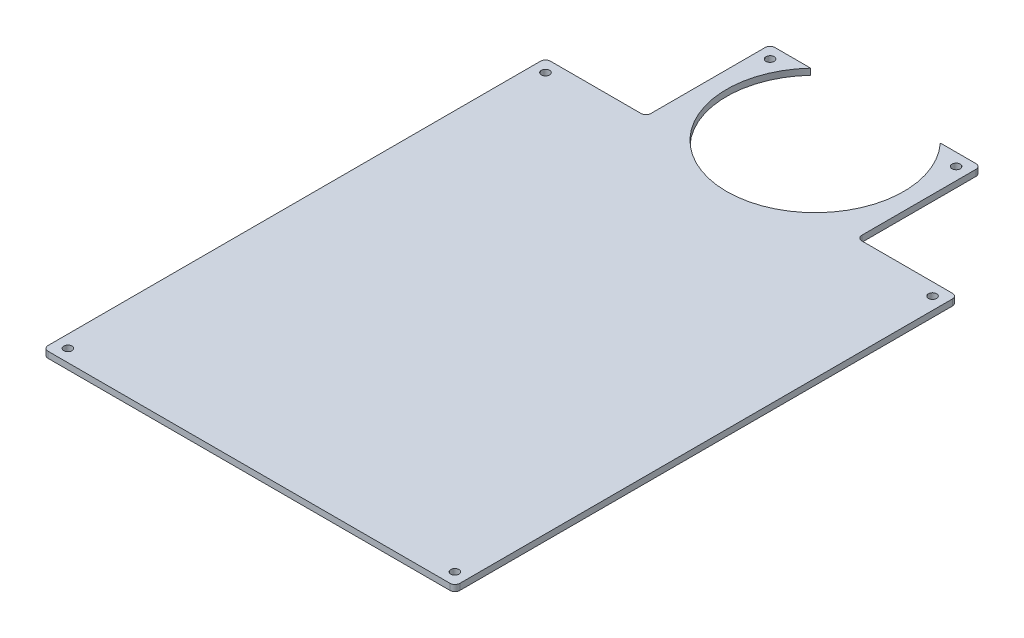
ISO-10303-21;
HEADER;
FILE_DESCRIPTION(('STEP AP214'),'2;1');
FILE_NAME('part.step','',(''),(''),'','','');
FILE_SCHEMA(('AUTOMOTIVE_DESIGN { 1 0 10303 214 1 1 1 1 }'));
ENDSEC;
DATA;
#1=APPLICATION_CONTEXT('core data for automotive mechanical design processes');
#2=APPLICATION_PROTOCOL_DEFINITION('international standard','automotive_design',2000,#1);
#3=PRODUCT_CONTEXT('',#1,'mechanical');
#4=PRODUCT('Part','Part','',(#3));
#5=PRODUCT_RELATED_PRODUCT_CATEGORY('part','',(#4));
#6=PRODUCT_DEFINITION_FORMATION('','',#4);
#7=PRODUCT_DEFINITION_CONTEXT('part definition',#1,'design');
#8=PRODUCT_DEFINITION('design','',#6,#7);
#9=PRODUCT_DEFINITION_SHAPE('','',#8);
#10=(LENGTH_UNIT() NAMED_UNIT(*) SI_UNIT(.MILLI.,.METRE.));
#11=(NAMED_UNIT(*) PLANE_ANGLE_UNIT() SI_UNIT($,.RADIAN.));
#12=(NAMED_UNIT(*) SI_UNIT($,.STERADIAN.) SOLID_ANGLE_UNIT());
#13=UNCERTAINTY_MEASURE_WITH_UNIT(LENGTH_MEASURE(1.E-05),#10,'distance_accuracy_value','');
#14=(GEOMETRIC_REPRESENTATION_CONTEXT(3) GLOBAL_UNCERTAINTY_ASSIGNED_CONTEXT((#13)) GLOBAL_UNIT_ASSIGNED_CONTEXT((#10,
#11,#12)) REPRESENTATION_CONTEXT('',''));
#15=CARTESIAN_POINT('',(0.,0.,0.));
#16=DIRECTION('',(0.,0.,1.));
#17=DIRECTION('',(1.,0.,0.));
#18=AXIS2_PLACEMENT_3D('',#15,#16,#17);
#19=CARTESIAN_POINT('',(0.,3.175,-244.475));
#20=DIRECTION('',(0.,0.,-1.));
#21=DIRECTION('',(-1.,0.,0.));
#22=AXIS2_PLACEMENT_3D('',#19,#20,#21);
#23=PLANE('',#22);
#24=DIRECTION('',(1.,0.,0.));
#25=VECTOR('',#24,1.);
#26=CARTESIAN_POINT('',(0.,3.175,-244.475));
#27=LINE('',#26,#25);
#28=CARTESIAN_POINT('',(-10.16,3.175,-244.475));
#29=VERTEX_POINT('',#28);
#30=CARTESIAN_POINT('',(36.195,3.175,-244.475));
#31=VERTEX_POINT('',#30);
#32=EDGE_CURVE('E267',#29,#31,#27,.T.);
#33=ORIENTED_EDGE('',*,*,#32,.T.);
#34=DIRECTION('',(0.,1.,0.));
#35=VECTOR('',#34,1.);
#36=CARTESIAN_POINT('',(36.195,3.175,-244.475));
#37=LINE('',#36,#35);
#38=CARTESIAN_POINT('',(36.195,0.,-244.475));
#39=VERTEX_POINT('',#38);
#40=EDGE_CURVE('E285',#31,#39,#37,.F.);
#41=ORIENTED_EDGE('',*,*,#40,.T.);
#42=DIRECTION('',(1.,0.,0.));
#43=VECTOR('',#42,1.);
#44=CARTESIAN_POINT('',(0.,0.,-244.475));
#45=LINE('',#44,#43);
#46=CARTESIAN_POINT('',(-10.16,0.,-244.475));
#47=VERTEX_POINT('',#46);
#48=EDGE_CURVE('E258',#47,#39,#45,.T.);
#49=ORIENTED_EDGE('',*,*,#48,.F.);
#50=DIRECTION('',(0.,-1.,0.));
#51=VECTOR('',#50,1.);
#52=CARTESIAN_POINT('',(-10.16,3.175,-244.475));
#53=LINE('',#52,#51);
#54=EDGE_CURVE('E283',#47,#29,#53,.F.);
#55=ORIENTED_EDGE('',*,*,#54,.T.);
#56=EDGE_LOOP('',(#33,#41,#49,#55));
#57=FACE_BOUND('',#56,.T.);
#58=ADVANCED_FACE('F50',(#57),#23,.T.);
#59=CARTESIAN_POINT('',(-12.7,3.175,0.));
#60=DIRECTION('',(-1.,0.,0.));
#61=DIRECTION('',(0.,0.,1.));
#62=AXIS2_PLACEMENT_3D('',#59,#60,#61);
#63=PLANE('',#62);
#64=DIRECTION('',(0.,0.,-1.));
#65=VECTOR('',#64,1.);
#66=CARTESIAN_POINT('',(-12.7,0.,0.));
#67=LINE('',#66,#65);
#68=CARTESIAN_POINT('',(-12.7,0.,10.16));
#69=VERTEX_POINT('',#68);
#70=CARTESIAN_POINT('',(-12.7,0.,-241.935));
#71=VERTEX_POINT('',#70);
#72=EDGE_CURVE('E198',#69,#71,#67,.T.);
#73=ORIENTED_EDGE('',*,*,#72,.F.);
#74=DIRECTION('',(0.,-1.,0.));
#75=VECTOR('',#74,1.);
#76=CARTESIAN_POINT('',(-12.7,3.175,10.16));
#77=LINE('',#76,#75);
#78=CARTESIAN_POINT('',(-12.7,3.175,10.16));
#79=VERTEX_POINT('',#78);
#80=EDGE_CURVE('E330',#69,#79,#77,.F.);
#81=ORIENTED_EDGE('',*,*,#80,.T.);
#82=DIRECTION('',(0.,0.,-1.));
#83=VECTOR('',#82,1.);
#84=CARTESIAN_POINT('',(-12.7,3.175,0.));
#85=LINE('',#84,#83);
#86=CARTESIAN_POINT('',(-12.7,3.175,-241.935));
#87=VERTEX_POINT('',#86);
#88=EDGE_CURVE('E254',#79,#87,#85,.T.);
#89=ORIENTED_EDGE('',*,*,#88,.T.);
#90=DIRECTION('',(0.,-1.,0.));
#91=VECTOR('',#90,1.);
#92=CARTESIAN_POINT('',(-12.7,3.175,-241.935));
#93=LINE('',#92,#91);
#94=EDGE_CURVE('E328',#87,#71,#93,.T.);
#95=ORIENTED_EDGE('',*,*,#94,.T.);
#96=EDGE_LOOP('',(#73,#81,#89,#95));
#97=FACE_BOUND('',#96,.T.);
#98=ADVANCED_FACE('F380',(#97),#63,.T.);
#99=CARTESIAN_POINT('',(0.,3.175,12.7));
#100=DIRECTION('',(0.,0.,-1.));
#101=DIRECTION('',(-1.,0.,0.));
#102=AXIS2_PLACEMENT_3D('',#99,#100,#101);
#103=PLANE('',#102);
#104=DIRECTION('',(1.,0.,0.));
#105=VECTOR('',#104,1.);
#106=CARTESIAN_POINT('',(0.,3.175,12.7));
#107=LINE('',#106,#105);
#108=CARTESIAN_POINT('',(-10.16,3.175,12.7));
#109=VERTEX_POINT('',#108);
#110=CARTESIAN_POINT('',(195.58,3.175,12.7));
#111=VERTEX_POINT('',#110);
#112=EDGE_CURVE('E257',#109,#111,#107,.T.);
#113=ORIENTED_EDGE('',*,*,#112,.F.);
#114=DIRECTION('',(0.,-1.,0.));
#115=VECTOR('',#114,1.);
#116=CARTESIAN_POINT('',(-10.16,0.,12.7));
#117=LINE('',#116,#115);
#118=CARTESIAN_POINT('',(-10.16,0.,12.7));
#119=VERTEX_POINT('',#118);
#120=EDGE_CURVE('E325',#109,#119,#117,.T.);
#121=ORIENTED_EDGE('',*,*,#120,.T.);
#122=DIRECTION('',(1.,0.,0.));
#123=VECTOR('',#122,1.);
#124=CARTESIAN_POINT('',(0.,0.,12.7));
#125=LINE('',#124,#123);
#126=CARTESIAN_POINT('',(195.58,0.,12.7));
#127=VERTEX_POINT('',#126);
#128=EDGE_CURVE('E269',#119,#127,#125,.T.);
#129=ORIENTED_EDGE('',*,*,#128,.T.);
#130=DIRECTION('',(0.,-1.,0.));
#131=VECTOR('',#130,1.);
#132=CARTESIAN_POINT('',(195.58,3.175,12.7));
#133=LINE('',#132,#131);
#134=EDGE_CURVE('E323',#127,#111,#133,.F.);
#135=ORIENTED_EDGE('',*,*,#134,.T.);
#136=EDGE_LOOP('',(#113,#121,#129,#135));
#137=FACE_BOUND('',#136,.T.);
#138=ADVANCED_FACE('F372',(#137),#103,.F.);
#139=CARTESIAN_POINT('',(198.12,3.175,0.));
#140=DIRECTION('',(-1.,0.,0.));
#141=DIRECTION('',(0.,0.,1.));
#142=AXIS2_PLACEMENT_3D('',#139,#140,#141);
#143=PLANE('',#142);
#144=DIRECTION('',(0.,0.,-1.));
#145=VECTOR('',#144,1.);
#146=CARTESIAN_POINT('',(198.12,0.,0.));
#147=LINE('',#146,#145);
#148=CARTESIAN_POINT('',(198.12,0.,10.16));
#149=VERTEX_POINT('',#148);
#150=CARTESIAN_POINT('',(198.12,0.,-241.935));
#151=VERTEX_POINT('',#150);
#152=EDGE_CURVE('E272',#149,#151,#147,.T.);
#153=ORIENTED_EDGE('',*,*,#152,.T.);
#154=DIRECTION('',(0.,-1.,0.));
#155=VECTOR('',#154,1.);
#156=CARTESIAN_POINT('',(198.12,3.175,-241.935));
#157=LINE('',#156,#155);
#158=CARTESIAN_POINT('',(198.12,3.175,-241.935));
#159=VERTEX_POINT('',#158);
#160=EDGE_CURVE('E335',#151,#159,#157,.F.);
#161=ORIENTED_EDGE('',*,*,#160,.T.);
#162=DIRECTION('',(0.,0.,-1.));
#163=VECTOR('',#162,1.);
#164=CARTESIAN_POINT('',(198.12,3.175,0.));
#165=LINE('',#164,#163);
#166=CARTESIAN_POINT('',(198.12,3.175,10.16));
#167=VERTEX_POINT('',#166);
#168=EDGE_CURVE('E261',#167,#159,#165,.T.);
#169=ORIENTED_EDGE('',*,*,#168,.F.);
#170=DIRECTION('',(0.,-1.,0.));
#171=VECTOR('',#170,1.);
#172=CARTESIAN_POINT('',(198.12,3.175,10.16));
#173=LINE('',#172,#171);
#174=EDGE_CURVE('E332',#167,#149,#173,.T.);
#175=ORIENTED_EDGE('',*,*,#174,.T.);
#176=EDGE_LOOP('',(#153,#161,#169,#175));
#177=FACE_BOUND('',#176,.T.);
#178=ADVANCED_FACE('F364',(#177),#143,.F.);
#179=CARTESIAN_POINT('',(149.225,0.,-244.475));
#180=VERTEX_POINT('',#179);
#181=CARTESIAN_POINT('',(195.58,0.,-244.475));
#182=VERTEX_POINT('',#181);
#183=EDGE_CURVE('E275',#180,#182,#45,.T.);
#184=ORIENTED_EDGE('',*,*,#183,.F.);
#185=DIRECTION('',(0.,1.,0.));
#186=VECTOR('',#185,1.);
#187=CARTESIAN_POINT('',(149.225,3.175,-244.475));
#188=LINE('',#187,#186);
#189=CARTESIAN_POINT('',(149.225,3.175,-244.475));
#190=VERTEX_POINT('',#189);
#191=EDGE_CURVE('E290',#180,#190,#188,.T.);
#192=ORIENTED_EDGE('',*,*,#191,.T.);
#193=CARTESIAN_POINT('',(195.58,3.175,-244.475));
#194=VERTEX_POINT('',#193);
#195=EDGE_CURVE('E264',#190,#194,#27,.T.);
#196=ORIENTED_EDGE('',*,*,#195,.T.);
#197=DIRECTION('',(0.,-1.,0.));
#198=VECTOR('',#197,1.);
#199=CARTESIAN_POINT('',(195.58,0.,-244.475));
#200=LINE('',#199,#198);
#201=EDGE_CURVE('E287',#194,#182,#200,.T.);
#202=ORIENTED_EDGE('',*,*,#201,.T.);
#203=EDGE_LOOP('',(#184,#192,#196,#202));
#204=FACE_BOUND('',#203,.T.);
#205=ADVANCED_FACE('F356',(#204),#23,.T.);
#206=CARTESIAN_POINT('',(0.,3.175,0.));
#207=DIRECTION('',(0.,1.,0.));
#208=DIRECTION('',(0.,0.,1.));
#209=AXIS2_PLACEMENT_3D('',#206,#207,#208);
#210=PLANE('',#209);
#211=CARTESIAN_POINT('',(-6.35,3.175,-238.125));
#212=DIRECTION('',(0.,1.,0.));
#213=DIRECTION('',(0.,0.,1.));
#214=AXIS2_PLACEMENT_3D('',#211,#212,#213);
#215=CIRCLE('',#214,2.09549999999999);
#216=CARTESIAN_POINT('',(-6.35,3.175,-236.0295));
#217=VERTEX_POINT('',#216);
#218=EDGE_CURVE('E229',#217,#217,#215,.T.);
#219=ORIENTED_EDGE('',*,*,#218,.F.);
#220=EDGE_LOOP('',(#219));
#221=FACE_BOUND('',#220,.T.);
#222=CARTESIAN_POINT('',(-6.35,3.175,6.35));
#223=DIRECTION('',(0.,1.,0.));
#224=DIRECTION('',(0.,0.,1.));
#225=AXIS2_PLACEMENT_3D('',#222,#223,#224);
#226=CIRCLE('',#225,2.0955);
#227=CARTESIAN_POINT('',(-6.35,3.175,8.4455));
#228=VERTEX_POINT('',#227);
#229=EDGE_CURVE('E245',#228,#228,#226,.T.);
#230=ORIENTED_EDGE('',*,*,#229,.F.);
#231=EDGE_LOOP('',(#230));
#232=FACE_BOUND('',#231,.T.);
#233=CARTESIAN_POINT('',(191.77,3.175,6.35));
#234=DIRECTION('',(0.,1.,0.));
#235=DIRECTION('',(0.,0.,1.));
#236=AXIS2_PLACEMENT_3D('',#233,#234,#235);
#237=CIRCLE('',#236,2.09549999999999);
#238=CARTESIAN_POINT('',(191.77,3.175,8.44549999999999));
#239=VERTEX_POINT('',#238);
#240=EDGE_CURVE('E239',#239,#239,#237,.T.);
#241=ORIENTED_EDGE('',*,*,#240,.F.);
#242=EDGE_LOOP('',(#241));
#243=FACE_BOUND('',#242,.T.);
#244=CARTESIAN_POINT('',(191.77,3.175,-238.125));
#245=DIRECTION('',(0.,1.,0.));
#246=DIRECTION('',(0.,0.,1.));
#247=AXIS2_PLACEMENT_3D('',#244,#245,#246);
#248=CIRCLE('',#247,2.09549999999998);
#249=CARTESIAN_POINT('',(191.77,3.175,-236.0295));
#250=VERTEX_POINT('',#249);
#251=EDGE_CURVE('E233',#250,#250,#248,.T.);
#252=ORIENTED_EDGE('',*,*,#251,.F.);
#253=EDGE_LOOP('',(#252));
#254=FACE_BOUND('',#253,.T.);
#255=DIRECTION('',(1.,0.,0.));
#256=VECTOR('',#255,1.);
#257=CARTESIAN_POINT('',(-1.58370049100942E-13,3.175,-307.975));
#258=LINE('',#257,#256);
#259=CARTESIAN_POINT('',(41.275,3.175,-307.975));
#260=VERTEX_POINT('',#259);
#261=CARTESIAN_POINT('',(59.5158438878167,3.175,-307.975));
#262=VERTEX_POINT('',#261);
#263=EDGE_CURVE('E203',#260,#262,#258,.T.);
#264=ORIENTED_EDGE('',*,*,#263,.F.);
#265=CARTESIAN_POINT('',(41.275,3.175,-305.435));
#266=DIRECTION('',(0.,1.,0.));
#267=DIRECTION('',(0.,0.,1.));
#268=AXIS2_PLACEMENT_3D('',#265,#266,#267);
#269=CIRCLE('',#268,2.54);
#270=CARTESIAN_POINT('',(38.735,3.175,-305.435));
#271=VERTEX_POINT('',#270);
#272=EDGE_CURVE('E310',#260,#271,#269,.T.);
#273=ORIENTED_EDGE('',*,*,#272,.T.);
#274=DIRECTION('',(0.,0.,-1.));
#275=VECTOR('',#274,1.);
#276=CARTESIAN_POINT('',(38.735,3.175,0.));
#277=LINE('',#276,#275);
#278=CARTESIAN_POINT('',(38.735,3.175,-247.015));
#279=VERTEX_POINT('',#278);
#280=EDGE_CURVE('E213',#279,#271,#277,.T.);
#281=ORIENTED_EDGE('',*,*,#280,.F.);
#282=CARTESIAN_POINT('',(36.195,3.175,-247.015));
#283=DIRECTION('',(0.,1.,0.));
#284=DIRECTION('',(0.,0.,1.));
#285=AXIS2_PLACEMENT_3D('',#282,#283,#284);
#286=CIRCLE('',#285,2.54);
#287=EDGE_CURVE('E337',#279,#31,#286,.F.);
#288=ORIENTED_EDGE('',*,*,#287,.T.);
#289=ORIENTED_EDGE('',*,*,#32,.F.);
#290=CARTESIAN_POINT('',(-10.16,3.175,-241.935));
#291=DIRECTION('',(0.,1.,0.));
#292=DIRECTION('',(0.,0.,1.));
#293=AXIS2_PLACEMENT_3D('',#290,#291,#292);
#294=CIRCLE('',#293,2.54);
#295=EDGE_CURVE('E304',#29,#87,#294,.T.);
#296=ORIENTED_EDGE('',*,*,#295,.T.);
#297=ORIENTED_EDGE('',*,*,#88,.F.);
#298=CARTESIAN_POINT('',(-10.16,3.175,10.16));
#299=DIRECTION('',(0.,1.,0.));
#300=DIRECTION('',(0.,0.,1.));
#301=AXIS2_PLACEMENT_3D('',#298,#299,#300);
#302=CIRCLE('',#301,2.54);
#303=EDGE_CURVE('E306',#79,#109,#302,.T.);
#304=ORIENTED_EDGE('',*,*,#303,.T.);
#305=ORIENTED_EDGE('',*,*,#112,.T.);
#306=CARTESIAN_POINT('',(195.58,3.175,10.16));
#307=DIRECTION('',(0.,1.,0.));
#308=DIRECTION('',(0.,0.,1.));
#309=AXIS2_PLACEMENT_3D('',#306,#307,#308);
#310=CIRCLE('',#309,2.54);
#311=EDGE_CURVE('E300',#111,#167,#310,.T.);
#312=ORIENTED_EDGE('',*,*,#311,.T.);
#313=ORIENTED_EDGE('',*,*,#168,.T.);
#314=CARTESIAN_POINT('',(195.58,3.175,-241.935));
#315=DIRECTION('',(0.,1.,0.));
#316=DIRECTION('',(0.,0.,1.));
#317=AXIS2_PLACEMENT_3D('',#314,#315,#316);
#318=CIRCLE('',#317,2.54);
#319=EDGE_CURVE('E302',#159,#194,#318,.T.);
#320=ORIENTED_EDGE('',*,*,#319,.T.);
#321=ORIENTED_EDGE('',*,*,#195,.F.);
#322=CARTESIAN_POINT('',(149.225,3.175,-247.015));
#323=DIRECTION('',(0.,1.,0.));
#324=DIRECTION('',(0.,0.,1.));
#325=AXIS2_PLACEMENT_3D('',#322,#323,#324);
#326=CIRCLE('',#325,2.54);
#327=CARTESIAN_POINT('',(146.685,3.175,-247.015));
#328=VERTEX_POINT('',#327);
#329=EDGE_CURVE('E58',#190,#328,#326,.F.);
#330=ORIENTED_EDGE('',*,*,#329,.T.);
#331=DIRECTION('',(0.,0.,-1.));
#332=VECTOR('',#331,1.);
#333=CARTESIAN_POINT('',(146.685,3.175,0.));
#334=LINE('',#333,#332);
#335=CARTESIAN_POINT('',(146.685,3.175,-305.435));
#336=VERTEX_POINT('',#335);
#337=EDGE_CURVE('E208',#328,#336,#334,.T.);
#338=ORIENTED_EDGE('',*,*,#337,.T.);
#339=CARTESIAN_POINT('',(144.145,3.175,-305.435));
#340=DIRECTION('',(0.,1.,0.));
#341=DIRECTION('',(0.,0.,1.));
#342=AXIS2_PLACEMENT_3D('',#339,#340,#341);
#343=CIRCLE('',#342,2.54);
#344=CARTESIAN_POINT('',(144.145,3.175,-307.975));
#345=VERTEX_POINT('',#344);
#346=EDGE_CURVE('E308',#336,#345,#343,.T.);
#347=ORIENTED_EDGE('',*,*,#346,.T.);
#348=DIRECTION('',(1.,0.,0.));
#349=VECTOR('',#348,1.);
#350=CARTESIAN_POINT('',(-1.58370049100942E-13,3.175,-307.975));
#351=LINE('',#350,#349);
#352=CARTESIAN_POINT('',(125.904156112183,3.175,-307.975));
#353=VERTEX_POINT('',#352);
#354=EDGE_CURVE('E219',#353,#345,#351,.T.);
#355=ORIENTED_EDGE('',*,*,#354,.F.);
#356=CARTESIAN_POINT('',(92.71,3.175,-277.105));
#357=DIRECTION('',(0.,1.,0.));
#358=DIRECTION('',(0.,0.,1.));
#359=AXIS2_PLACEMENT_3D('',#356,#357,#358);
#360=CIRCLE('',#359,45.33);
#361=EDGE_CURVE('E199',#262,#353,#360,.T.);
#362=ORIENTED_EDGE('',*,*,#361,.F.);
#363=EDGE_LOOP('',(#264,#273,#281,#288,#289,#296,#297,#304,#305,#312,#313,#320,#321,#330,#338,
#347,#355,#362));
#364=FACE_BOUND('',#363,.T.);
#365=CARTESIAN_POINT('',(140.335,3.175,-301.625));
#366=DIRECTION('',(0.,1.,0.));
#367=DIRECTION('',(0.,0.,1.));
#368=AXIS2_PLACEMENT_3D('',#365,#366,#367);
#369=CIRCLE('',#368,2.09549999999998);
#370=CARTESIAN_POINT('',(140.335,3.175,-299.5295));
#371=VERTEX_POINT('',#370);
#372=EDGE_CURVE('E205',#371,#371,#369,.T.);
#373=ORIENTED_EDGE('',*,*,#372,.F.);
#374=EDGE_LOOP('',(#373));
#375=FACE_BOUND('',#374,.T.);
#376=CARTESIAN_POINT('',(45.085,3.175,-301.625));
#377=DIRECTION('',(0.,1.,0.));
#378=DIRECTION('',(0.,0.,1.));
#379=AXIS2_PLACEMENT_3D('',#376,#377,#378);
#380=CIRCLE('',#379,2.0955);
#381=CARTESIAN_POINT('',(45.085,3.175,-299.5295));
#382=VERTEX_POINT('',#381);
#383=EDGE_CURVE('E402',#382,#382,#380,.T.);
#384=ORIENTED_EDGE('',*,*,#383,.F.);
#385=EDGE_LOOP('',(#384));
#386=FACE_BOUND('',#385,.T.);
#387=ADVANCED_FACE('F343',(#221,#232,#243,#254,#364,#375,#386),#210,.T.);
#388=CARTESIAN_POINT('',(0.,0.,0.));
#389=DIRECTION('',(0.,1.,0.));
#390=DIRECTION('',(0.,0.,1.));
#391=AXIS2_PLACEMENT_3D('',#388,#389,#390);
#392=PLANE('',#391);
#393=CARTESIAN_POINT('',(-6.35,0.,-238.125));
#394=DIRECTION('',(0.,1.,0.));
#395=DIRECTION('',(0.,0.,1.));
#396=AXIS2_PLACEMENT_3D('',#393,#394,#395);
#397=CIRCLE('',#396,2.09549999999999);
#398=CARTESIAN_POINT('',(-6.35,0.,-236.0295));
#399=VERTEX_POINT('',#398);
#400=EDGE_CURVE('E248',#399,#399,#397,.T.);
#401=ORIENTED_EDGE('',*,*,#400,.T.);
#402=EDGE_LOOP('',(#401));
#403=FACE_BOUND('',#402,.T.);
#404=CARTESIAN_POINT('',(-6.35,0.,6.35));
#405=DIRECTION('',(0.,1.,0.));
#406=DIRECTION('',(0.,0.,1.));
#407=AXIS2_PLACEMENT_3D('',#404,#405,#406);
#408=CIRCLE('',#407,2.0955);
#409=CARTESIAN_POINT('',(-6.35,0.,8.4455));
#410=VERTEX_POINT('',#409);
#411=EDGE_CURVE('E242',#410,#410,#408,.T.);
#412=ORIENTED_EDGE('',*,*,#411,.T.);
#413=EDGE_LOOP('',(#412));
#414=FACE_BOUND('',#413,.T.);
#415=CARTESIAN_POINT('',(191.77,0.,6.35));
#416=DIRECTION('',(0.,1.,0.));
#417=DIRECTION('',(0.,0.,1.));
#418=AXIS2_PLACEMENT_3D('',#415,#416,#417);
#419=CIRCLE('',#418,2.09549999999999);
#420=CARTESIAN_POINT('',(191.77,0.,8.44549999999999));
#421=VERTEX_POINT('',#420);
#422=EDGE_CURVE('E236',#421,#421,#419,.T.);
#423=ORIENTED_EDGE('',*,*,#422,.T.);
#424=EDGE_LOOP('',(#423));
#425=FACE_BOUND('',#424,.T.);
#426=CARTESIAN_POINT('',(191.77,0.,-238.125));
#427=DIRECTION('',(0.,1.,0.));
#428=DIRECTION('',(0.,0.,1.));
#429=AXIS2_PLACEMENT_3D('',#426,#427,#428);
#430=CIRCLE('',#429,2.09549999999998);
#431=CARTESIAN_POINT('',(191.77,0.,-236.0295));
#432=VERTEX_POINT('',#431);
#433=EDGE_CURVE('E230',#432,#432,#430,.T.);
#434=ORIENTED_EDGE('',*,*,#433,.T.);
#435=EDGE_LOOP('',(#434));
#436=FACE_BOUND('',#435,.T.);
#437=DIRECTION('',(0.,0.,-1.));
#438=VECTOR('',#437,1.);
#439=CARTESIAN_POINT('',(38.735,0.,0.));
#440=LINE('',#439,#438);
#441=CARTESIAN_POINT('',(38.735,0.,-247.015));
#442=VERTEX_POINT('',#441);
#443=CARTESIAN_POINT('',(38.735,0.,-305.435));
#444=VERTEX_POINT('',#443);
#445=EDGE_CURVE('E188',#442,#444,#440,.T.);
#446=ORIENTED_EDGE('',*,*,#445,.T.);
#447=CARTESIAN_POINT('',(41.275,0.,-305.435));
#448=DIRECTION('',(0.,1.,0.));
#449=DIRECTION('',(0.,0.,1.));
#450=AXIS2_PLACEMENT_3D('',#447,#448,#449);
#451=CIRCLE('',#450,2.54);
#452=CARTESIAN_POINT('',(41.275,0.,-307.975));
#453=VERTEX_POINT('',#452);
#454=EDGE_CURVE('E183',#444,#453,#451,.F.);
#455=ORIENTED_EDGE('',*,*,#454,.T.);
#456=DIRECTION('',(1.,0.,0.));
#457=VECTOR('',#456,1.);
#458=CARTESIAN_POINT('',(-1.58370049100942E-13,0.,-307.975));
#459=LINE('',#458,#457);
#460=CARTESIAN_POINT('',(59.5158438878167,0.,-307.975));
#461=VERTEX_POINT('',#460);
#462=EDGE_CURVE('E174',#453,#461,#459,.T.);
#463=ORIENTED_EDGE('',*,*,#462,.T.);
#464=CARTESIAN_POINT('',(92.71,0.,-277.105));
#465=DIRECTION('',(0.,1.,0.));
#466=DIRECTION('',(0.,0.,1.));
#467=AXIS2_PLACEMENT_3D('',#464,#465,#466);
#468=CIRCLE('',#467,45.33);
#469=CARTESIAN_POINT('',(125.904156112183,0.,-307.975));
#470=VERTEX_POINT('',#469);
#471=EDGE_CURVE('E180',#461,#470,#468,.T.);
#472=ORIENTED_EDGE('',*,*,#471,.T.);
#473=DIRECTION('',(1.,0.,0.));
#474=VECTOR('',#473,1.);
#475=CARTESIAN_POINT('',(-1.58370049100942E-13,0.,-307.975));
#476=LINE('',#475,#474);
#477=CARTESIAN_POINT('',(144.145,0.,-307.975));
#478=VERTEX_POINT('',#477);
#479=EDGE_CURVE('E222',#470,#478,#476,.T.);
#480=ORIENTED_EDGE('',*,*,#479,.T.);
#481=CARTESIAN_POINT('',(144.145,0.,-305.435));
#482=DIRECTION('',(0.,1.,0.));
#483=DIRECTION('',(0.,0.,1.));
#484=AXIS2_PLACEMENT_3D('',#481,#482,#483);
#485=CIRCLE('',#484,2.54);
#486=CARTESIAN_POINT('',(146.685,0.,-305.435));
#487=VERTEX_POINT('',#486);
#488=EDGE_CURVE('E318',#478,#487,#485,.F.);
#489=ORIENTED_EDGE('',*,*,#488,.T.);
#490=DIRECTION('',(0.,0.,-1.));
#491=VECTOR('',#490,1.);
#492=CARTESIAN_POINT('',(146.685,0.,0.));
#493=LINE('',#492,#491);
#494=CARTESIAN_POINT('',(146.685,0.,-247.015));
#495=VERTEX_POINT('',#494);
#496=EDGE_CURVE('E218',#495,#487,#493,.T.);
#497=ORIENTED_EDGE('',*,*,#496,.F.);
#498=CARTESIAN_POINT('',(149.225,0.,-247.015));
#499=DIRECTION('',(0.,1.,0.));
#500=DIRECTION('',(0.,0.,1.));
#501=AXIS2_PLACEMENT_3D('',#498,#499,#500);
#502=CIRCLE('',#501,2.54);
#503=EDGE_CURVE('E11',#495,#180,#502,.T.);
#504=ORIENTED_EDGE('',*,*,#503,.T.);
#505=ORIENTED_EDGE('',*,*,#183,.T.);
#506=CARTESIAN_POINT('',(195.58,0.,-241.935));
#507=DIRECTION('',(0.,1.,0.));
#508=DIRECTION('',(0.,0.,1.));
#509=AXIS2_PLACEMENT_3D('',#506,#507,#508);
#510=CIRCLE('',#509,2.54);
#511=EDGE_CURVE('E314',#182,#151,#510,.F.);
#512=ORIENTED_EDGE('',*,*,#511,.T.);
#513=ORIENTED_EDGE('',*,*,#152,.F.);
#514=CARTESIAN_POINT('',(195.58,0.,10.16));
#515=DIRECTION('',(0.,1.,0.));
#516=DIRECTION('',(0.,0.,1.));
#517=AXIS2_PLACEMENT_3D('',#514,#515,#516);
#518=CIRCLE('',#517,2.54);
#519=EDGE_CURVE('E312',#149,#127,#518,.F.);
#520=ORIENTED_EDGE('',*,*,#519,.T.);
#521=ORIENTED_EDGE('',*,*,#128,.F.);
#522=CARTESIAN_POINT('',(-10.16,0.,10.16));
#523=DIRECTION('',(0.,1.,0.));
#524=DIRECTION('',(0.,0.,1.));
#525=AXIS2_PLACEMENT_3D('',#522,#523,#524);
#526=CIRCLE('',#525,2.54);
#527=EDGE_CURVE('E73',#119,#69,#526,.F.);
#528=ORIENTED_EDGE('',*,*,#527,.T.);
#529=ORIENTED_EDGE('',*,*,#72,.T.);
#530=CARTESIAN_POINT('',(-10.16,0.,-241.935));
#531=DIRECTION('',(0.,1.,0.));
#532=DIRECTION('',(0.,0.,1.));
#533=AXIS2_PLACEMENT_3D('',#530,#531,#532);
#534=CIRCLE('',#533,2.54);
#535=EDGE_CURVE('E65',#71,#47,#534,.F.);
#536=ORIENTED_EDGE('',*,*,#535,.T.);
#537=ORIENTED_EDGE('',*,*,#48,.T.);
#538=CARTESIAN_POINT('',(36.195,0.,-247.015));
#539=DIRECTION('',(0.,1.,0.));
#540=DIRECTION('',(0.,0.,1.));
#541=AXIS2_PLACEMENT_3D('',#538,#539,#540);
#542=CIRCLE('',#541,2.54);
#543=EDGE_CURVE('E339',#39,#442,#542,.T.);
#544=ORIENTED_EDGE('',*,*,#543,.T.);
#545=EDGE_LOOP('',(#446,#455,#463,#472,#480,#489,#497,#504,#505,#512,#513,#520,#521,#528,#529,
#536,#537,#544));
#546=FACE_BOUND('',#545,.T.);
#547=CARTESIAN_POINT('',(140.335,0.,-301.625));
#548=DIRECTION('',(0.,1.,0.));
#549=DIRECTION('',(0.,0.,1.));
#550=AXIS2_PLACEMENT_3D('',#547,#548,#549);
#551=CIRCLE('',#550,2.09549999999998);
#552=CARTESIAN_POINT('',(140.335,0.,-299.5295));
#553=VERTEX_POINT('',#552);
#554=EDGE_CURVE('E215',#553,#553,#551,.T.);
#555=ORIENTED_EDGE('',*,*,#554,.T.);
#556=EDGE_LOOP('',(#555));
#557=FACE_BOUND('',#556,.T.);
#558=CARTESIAN_POINT('',(45.085,0.,-301.625));
#559=DIRECTION('',(0.,1.,0.));
#560=DIRECTION('',(0.,0.,1.));
#561=AXIS2_PLACEMENT_3D('',#558,#559,#560);
#562=CIRCLE('',#561,2.0955);
#563=CARTESIAN_POINT('',(45.085,0.,-299.5295));
#564=VERTEX_POINT('',#563);
#565=EDGE_CURVE('E189',#564,#564,#562,.T.);
#566=ORIENTED_EDGE('',*,*,#565,.T.);
#567=EDGE_LOOP('',(#566));
#568=FACE_BOUND('',#567,.T.);
#569=ADVANCED_FACE('F177',(#403,#414,#425,#436,#546,#557,#568),#392,.F.);
#570=CARTESIAN_POINT('',(92.71,0.,-277.105));
#571=DIRECTION('',(0.,1.,0.));
#572=DIRECTION('',(0.,0.,1.));
#573=AXIS2_PLACEMENT_3D('',#570,#571,#572);
#574=CYLINDRICAL_SURFACE('',#573,45.33);
#575=ORIENTED_EDGE('',*,*,#361,.T.);
#576=DIRECTION('',(0.,1.,0.));
#577=VECTOR('',#576,1.);
#578=CARTESIAN_POINT('',(125.904156112183,0.,-307.975));
#579=LINE('',#578,#577);
#580=EDGE_CURVE('E197',#470,#353,#579,.T.);
#581=ORIENTED_EDGE('',*,*,#580,.F.);
#582=ORIENTED_EDGE('',*,*,#471,.F.);
#583=DIRECTION('',(0.,1.,0.));
#584=VECTOR('',#583,1.);
#585=CARTESIAN_POINT('',(59.5158438878167,0.,-307.975));
#586=LINE('',#585,#584);
#587=EDGE_CURVE('E195',#461,#262,#586,.T.);
#588=ORIENTED_EDGE('',*,*,#587,.T.);
#589=EDGE_LOOP('',(#575,#581,#582,#588));
#590=FACE_BOUND('',#589,.T.);
#591=ADVANCED_FACE('F194',(#590),#574,.F.);
#592=CARTESIAN_POINT('',(191.77,0.,-238.125));
#593=DIRECTION('',(0.,1.,0.));
#594=DIRECTION('',(0.,0.,1.));
#595=AXIS2_PLACEMENT_3D('',#592,#593,#594);
#596=CYLINDRICAL_SURFACE('',#595,2.09549999999998);
#597=ORIENTED_EDGE('',*,*,#433,.F.);
#598=EDGE_LOOP('',(#597));
#599=FACE_BOUND('',#598,.T.);
#600=ORIENTED_EDGE('',*,*,#251,.T.);
#601=EDGE_LOOP('',(#600));
#602=FACE_BOUND('',#601,.T.);
#603=ADVANCED_FACE('F598',(#599,#602),#596,.F.);
#604=CARTESIAN_POINT('',(191.77,0.,6.35));
#605=DIRECTION('',(0.,1.,0.));
#606=DIRECTION('',(0.,0.,1.));
#607=AXIS2_PLACEMENT_3D('',#604,#605,#606);
#608=CYLINDRICAL_SURFACE('',#607,2.09549999999999);
#609=ORIENTED_EDGE('',*,*,#422,.F.);
#610=EDGE_LOOP('',(#609));
#611=FACE_BOUND('',#610,.T.);
#612=ORIENTED_EDGE('',*,*,#240,.T.);
#613=EDGE_LOOP('',(#612));
#614=FACE_BOUND('',#613,.T.);
#615=ADVANCED_FACE('F605',(#611,#614),#608,.F.);
#616=CARTESIAN_POINT('',(-6.35,0.,6.35));
#617=DIRECTION('',(0.,1.,0.));
#618=DIRECTION('',(0.,0.,1.));
#619=AXIS2_PLACEMENT_3D('',#616,#617,#618);
#620=CYLINDRICAL_SURFACE('',#619,2.0955);
#621=ORIENTED_EDGE('',*,*,#411,.F.);
#622=EDGE_LOOP('',(#621));
#623=FACE_BOUND('',#622,.T.);
#624=ORIENTED_EDGE('',*,*,#229,.T.);
#625=EDGE_LOOP('',(#624));
#626=FACE_BOUND('',#625,.T.);
#627=ADVANCED_FACE('F614',(#623,#626),#620,.F.);
#628=CARTESIAN_POINT('',(-6.35,0.,-238.125));
#629=DIRECTION('',(0.,1.,0.));
#630=DIRECTION('',(0.,0.,1.));
#631=AXIS2_PLACEMENT_3D('',#628,#629,#630);
#632=CYLINDRICAL_SURFACE('',#631,2.09549999999999);
#633=ORIENTED_EDGE('',*,*,#400,.F.);
#634=EDGE_LOOP('',(#633));
#635=FACE_BOUND('',#634,.T.);
#636=ORIENTED_EDGE('',*,*,#218,.T.);
#637=EDGE_LOOP('',(#636));
#638=FACE_BOUND('',#637,.T.);
#639=ADVANCED_FACE('F534',(#635,#638),#632,.F.);
#640=CARTESIAN_POINT('',(146.685,0.,0.));
#641=DIRECTION('',(1.,0.,0.));
#642=DIRECTION('',(0.,0.,-1.));
#643=AXIS2_PLACEMENT_3D('',#640,#641,#642);
#644=PLANE('',#643);
#645=ORIENTED_EDGE('',*,*,#337,.F.);
#646=DIRECTION('',(0.,1.,0.));
#647=VECTOR('',#646,1.);
#648=CARTESIAN_POINT('',(146.685,0.,-247.015));
#649=LINE('',#648,#647);
#650=EDGE_CURVE('E296',#328,#495,#649,.F.);
#651=ORIENTED_EDGE('',*,*,#650,.T.);
#652=ORIENTED_EDGE('',*,*,#496,.T.);
#653=DIRECTION('',(0.,1.,0.));
#654=VECTOR('',#653,1.);
#655=CARTESIAN_POINT('',(146.685,3.175,-305.435));
#656=LINE('',#655,#654);
#657=EDGE_CURVE('E293',#487,#336,#656,.T.);
#658=ORIENTED_EDGE('',*,*,#657,.T.);
#659=EDGE_LOOP('',(#645,#651,#652,#658));
#660=FACE_BOUND('',#659,.T.);
#661=ADVANCED_FACE('F349',(#660),#644,.T.);
#662=CARTESIAN_POINT('',(140.335,0.,-301.625));
#663=DIRECTION('',(0.,1.,0.));
#664=DIRECTION('',(0.,0.,1.));
#665=AXIS2_PLACEMENT_3D('',#662,#663,#664);
#666=CYLINDRICAL_SURFACE('',#665,2.09549999999998);
#667=ORIENTED_EDGE('',*,*,#554,.F.);
#668=EDGE_LOOP('',(#667));
#669=FACE_BOUND('',#668,.T.);
#670=ORIENTED_EDGE('',*,*,#372,.T.);
#671=EDGE_LOOP('',(#670));
#672=FACE_BOUND('',#671,.T.);
#673=ADVANCED_FACE('F525',(#669,#672),#666,.F.);
#674=CARTESIAN_POINT('',(-1.58370049100942E-13,0.,-307.975));
#675=DIRECTION('',(0.,0.,1.));
#676=DIRECTION('',(1.,0.,0.));
#677=AXIS2_PLACEMENT_3D('',#674,#675,#676);
#678=PLANE('',#677);
#679=ORIENTED_EDGE('',*,*,#354,.T.);
#680=DIRECTION('',(0.,1.,0.));
#681=VECTOR('',#680,1.);
#682=CARTESIAN_POINT('',(144.145,0.,-307.975));
#683=LINE('',#682,#681);
#684=EDGE_CURVE('E321',#345,#478,#683,.F.);
#685=ORIENTED_EDGE('',*,*,#684,.T.);
#686=ORIENTED_EDGE('',*,*,#479,.F.);
#687=ORIENTED_EDGE('',*,*,#580,.T.);
#688=EDGE_LOOP('',(#679,#685,#686,#687));
#689=FACE_BOUND('',#688,.T.);
#690=ADVANCED_FACE('F517',(#689),#678,.F.);
#691=CARTESIAN_POINT('',(-1.58370049100942E-13,0.,-307.975));
#692=DIRECTION('',(0.,0.,1.));
#693=DIRECTION('',(1.,0.,0.));
#694=AXIS2_PLACEMENT_3D('',#691,#692,#693);
#695=PLANE('',#694);
#696=ORIENTED_EDGE('',*,*,#462,.F.);
#697=DIRECTION('',(0.,1.,0.));
#698=VECTOR('',#697,1.);
#699=CARTESIAN_POINT('',(41.275,0.,-307.975));
#700=LINE('',#699,#698);
#701=EDGE_CURVE('E298',#453,#260,#700,.T.);
#702=ORIENTED_EDGE('',*,*,#701,.T.);
#703=ORIENTED_EDGE('',*,*,#263,.T.);
#704=ORIENTED_EDGE('',*,*,#587,.F.);
#705=EDGE_LOOP('',(#696,#702,#703,#704));
#706=FACE_BOUND('',#705,.T.);
#707=ADVANCED_FACE('F201',(#706),#695,.F.);
#708=CARTESIAN_POINT('',(45.085,0.,-301.625));
#709=DIRECTION('',(0.,1.,0.));
#710=DIRECTION('',(0.,0.,1.));
#711=AXIS2_PLACEMENT_3D('',#708,#709,#710);
#712=CYLINDRICAL_SURFACE('',#711,2.0955);
#713=ORIENTED_EDGE('',*,*,#565,.F.);
#714=EDGE_LOOP('',(#713));
#715=FACE_BOUND('',#714,.T.);
#716=ORIENTED_EDGE('',*,*,#383,.T.);
#717=EDGE_LOOP('',(#716));
#718=FACE_BOUND('',#717,.T.);
#719=ADVANCED_FACE('F410',(#715,#718),#712,.F.);
#720=CARTESIAN_POINT('',(38.735,0.,0.));
#721=DIRECTION('',(1.,0.,0.));
#722=DIRECTION('',(0.,0.,-1.));
#723=AXIS2_PLACEMENT_3D('',#720,#721,#722);
#724=PLANE('',#723);
#725=ORIENTED_EDGE('',*,*,#445,.F.);
#726=DIRECTION('',(0.,1.,0.));
#727=VECTOR('',#726,1.);
#728=CARTESIAN_POINT('',(38.735,0.,-247.015));
#729=LINE('',#728,#727);
#730=EDGE_CURVE('E280',#442,#279,#729,.T.);
#731=ORIENTED_EDGE('',*,*,#730,.T.);
#732=ORIENTED_EDGE('',*,*,#280,.T.);
#733=DIRECTION('',(0.,1.,0.));
#734=VECTOR('',#733,1.);
#735=CARTESIAN_POINT('',(38.735,0.,-305.435));
#736=LINE('',#735,#734);
#737=EDGE_CURVE('E278',#271,#444,#736,.F.);
#738=ORIENTED_EDGE('',*,*,#737,.T.);
#739=EDGE_LOOP('',(#725,#731,#732,#738));
#740=FACE_BOUND('',#739,.T.);
#741=ADVANCED_FACE('F395',(#740),#724,.F.);
#742=CARTESIAN_POINT('',(36.195,0.,-247.015));
#743=DIRECTION('',(0.,1.,0.));
#744=DIRECTION('',(0.,0.,1.));
#745=AXIS2_PLACEMENT_3D('',#742,#743,#744);
#746=CYLINDRICAL_SURFACE('',#745,2.54);
#747=ORIENTED_EDGE('',*,*,#543,.F.);
#748=ORIENTED_EDGE('',*,*,#40,.F.);
#749=ORIENTED_EDGE('',*,*,#287,.F.);
#750=ORIENTED_EDGE('',*,*,#730,.F.);
#751=EDGE_LOOP('',(#747,#748,#749,#750));
#752=FACE_BOUND('',#751,.T.);
#753=ADVANCED_FACE('F391',(#752),#746,.F.);
#754=CARTESIAN_POINT('',(149.225,3.175,-247.015));
#755=DIRECTION('',(0.,-1.,0.));
#756=DIRECTION('',(0.,0.,-1.));
#757=AXIS2_PLACEMENT_3D('',#754,#755,#756);
#758=CYLINDRICAL_SURFACE('',#757,2.54);
#759=ORIENTED_EDGE('',*,*,#503,.F.);
#760=ORIENTED_EDGE('',*,*,#650,.F.);
#761=ORIENTED_EDGE('',*,*,#329,.F.);
#762=ORIENTED_EDGE('',*,*,#191,.F.);
#763=EDGE_LOOP('',(#759,#760,#761,#762));
#764=FACE_BOUND('',#763,.T.);
#765=ADVANCED_FACE('F353',(#764),#758,.F.);
#766=CARTESIAN_POINT('',(41.275,0.,-305.435));
#767=DIRECTION('',(0.,1.,0.));
#768=DIRECTION('',(0.,0.,1.));
#769=AXIS2_PLACEMENT_3D('',#766,#767,#768);
#770=CYLINDRICAL_SURFACE('',#769,2.54);
#771=ORIENTED_EDGE('',*,*,#454,.F.);
#772=ORIENTED_EDGE('',*,*,#737,.F.);
#773=ORIENTED_EDGE('',*,*,#272,.F.);
#774=ORIENTED_EDGE('',*,*,#701,.F.);
#775=EDGE_LOOP('',(#771,#772,#773,#774));
#776=FACE_BOUND('',#775,.T.);
#777=ADVANCED_FACE('F400',(#776),#770,.T.);
#778=CARTESIAN_POINT('',(144.145,0.,-305.435));
#779=DIRECTION('',(0.,-1.,0.));
#780=DIRECTION('',(0.,0.,-1.));
#781=AXIS2_PLACEMENT_3D('',#778,#779,#780);
#782=CYLINDRICAL_SURFACE('',#781,2.54);
#783=ORIENTED_EDGE('',*,*,#488,.F.);
#784=ORIENTED_EDGE('',*,*,#684,.F.);
#785=ORIENTED_EDGE('',*,*,#346,.F.);
#786=ORIENTED_EDGE('',*,*,#657,.F.);
#787=EDGE_LOOP('',(#783,#784,#785,#786));
#788=FACE_BOUND('',#787,.T.);
#789=ADVANCED_FACE('F445',(#788),#782,.T.);
#790=CARTESIAN_POINT('',(-10.16,3.175,10.16));
#791=DIRECTION('',(0.,1.,0.));
#792=DIRECTION('',(0.,0.,1.));
#793=AXIS2_PLACEMENT_3D('',#790,#791,#792);
#794=CYLINDRICAL_SURFACE('',#793,2.54);
#795=ORIENTED_EDGE('',*,*,#303,.F.);
#796=ORIENTED_EDGE('',*,*,#80,.F.);
#797=ORIENTED_EDGE('',*,*,#527,.F.);
#798=ORIENTED_EDGE('',*,*,#120,.F.);
#799=EDGE_LOOP('',(#795,#796,#797,#798));
#800=FACE_BOUND('',#799,.T.);
#801=ADVANCED_FACE('F376',(#800),#794,.T.);
#802=CARTESIAN_POINT('',(-10.16,3.175,-241.935));
#803=DIRECTION('',(0.,-1.,0.));
#804=DIRECTION('',(0.,0.,-1.));
#805=AXIS2_PLACEMENT_3D('',#802,#803,#804);
#806=CYLINDRICAL_SURFACE('',#805,2.54);
#807=ORIENTED_EDGE('',*,*,#295,.F.);
#808=ORIENTED_EDGE('',*,*,#54,.F.);
#809=ORIENTED_EDGE('',*,*,#535,.F.);
#810=ORIENTED_EDGE('',*,*,#94,.F.);
#811=EDGE_LOOP('',(#807,#808,#809,#810));
#812=FACE_BOUND('',#811,.T.);
#813=ADVANCED_FACE('F384',(#812),#806,.T.);
#814=CARTESIAN_POINT('',(195.58,3.175,-241.935));
#815=DIRECTION('',(0.,1.,0.));
#816=DIRECTION('',(0.,0.,1.));
#817=AXIS2_PLACEMENT_3D('',#814,#815,#816);
#818=CYLINDRICAL_SURFACE('',#817,2.54);
#819=ORIENTED_EDGE('',*,*,#319,.F.);
#820=ORIENTED_EDGE('',*,*,#160,.F.);
#821=ORIENTED_EDGE('',*,*,#511,.F.);
#822=ORIENTED_EDGE('',*,*,#201,.F.);
#823=EDGE_LOOP('',(#819,#820,#821,#822));
#824=FACE_BOUND('',#823,.T.);
#825=ADVANCED_FACE('F360',(#824),#818,.T.);
#826=CARTESIAN_POINT('',(195.58,3.175,10.16));
#827=DIRECTION('',(0.,-1.,0.));
#828=DIRECTION('',(0.,0.,-1.));
#829=AXIS2_PLACEMENT_3D('',#826,#827,#828);
#830=CYLINDRICAL_SURFACE('',#829,2.54);
#831=ORIENTED_EDGE('',*,*,#311,.F.);
#832=ORIENTED_EDGE('',*,*,#134,.F.);
#833=ORIENTED_EDGE('',*,*,#519,.F.);
#834=ORIENTED_EDGE('',*,*,#174,.F.);
#835=EDGE_LOOP('',(#831,#832,#833,#834));
#836=FACE_BOUND('',#835,.T.);
#837=ADVANCED_FACE('F52',(#836),#830,.T.);
#838=CLOSED_SHELL('',(#58,#98,#138,#178,#205,#387,#569,#591,#603,#615,#627,#639,#661,#673,#690,
#707,#719,#741,#753,#765,#777,#789,#801,#813,#825,#837));
#839=MANIFOLD_SOLID_BREP('B2',#838);
#840=ADVANCED_BREP_SHAPE_REPRESENTATION('',(#18,#839),#14);
#841=SHAPE_DEFINITION_REPRESENTATION(#9,#840);
ENDSEC;
END-ISO-10303-21;
